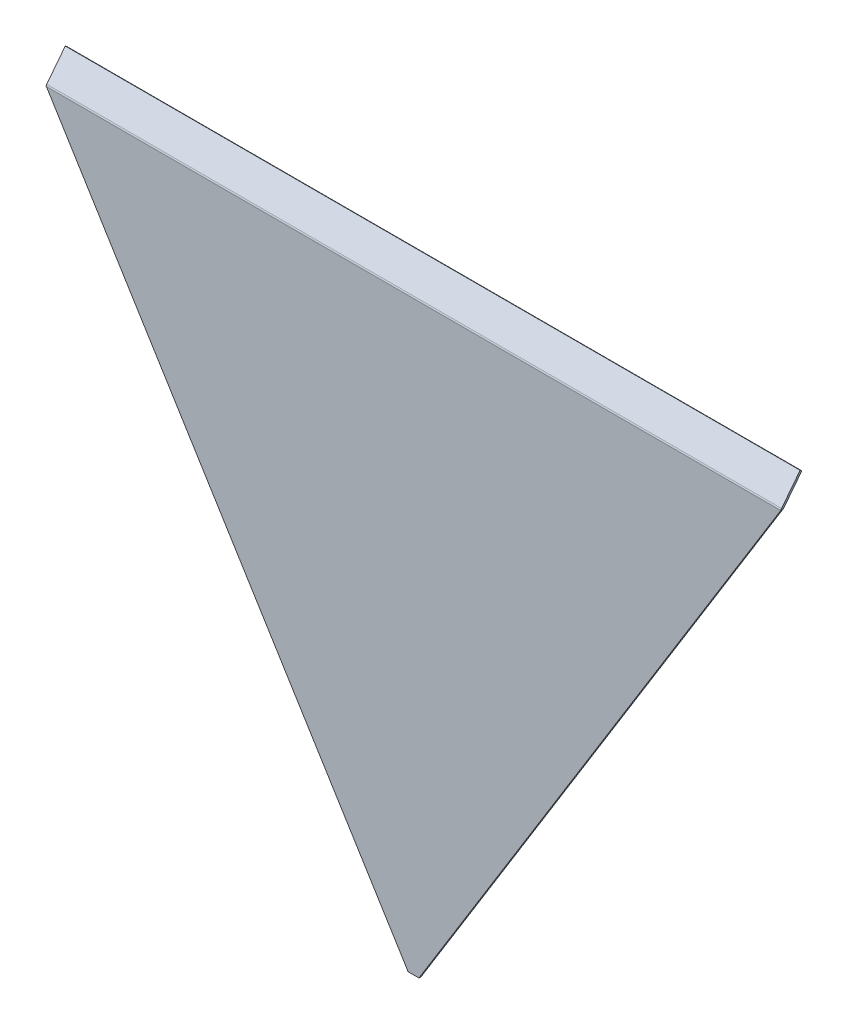
ISO-10303-21;
HEADER;
FILE_DESCRIPTION(('STEP AP214'),'2;1');
FILE_NAME('part.step','',(''),(''),'','','');
FILE_SCHEMA(('AUTOMOTIVE_DESIGN { 1 0 10303 214 1 1 1 1 }'));
ENDSEC;
DATA;
#1=APPLICATION_CONTEXT('core data for automotive mechanical design processes');
#2=APPLICATION_PROTOCOL_DEFINITION('international standard','automotive_design',2000,#1);
#3=PRODUCT_CONTEXT('',#1,'mechanical');
#4=PRODUCT('Part','Part','',(#3));
#5=PRODUCT_RELATED_PRODUCT_CATEGORY('part','',(#4));
#6=PRODUCT_DEFINITION_FORMATION('','',#4);
#7=PRODUCT_DEFINITION_CONTEXT('part definition',#1,'design');
#8=PRODUCT_DEFINITION('design','',#6,#7);
#9=PRODUCT_DEFINITION_SHAPE('','',#8);
#10=(LENGTH_UNIT() NAMED_UNIT(*) SI_UNIT(.MILLI.,.METRE.));
#11=(NAMED_UNIT(*) PLANE_ANGLE_UNIT() SI_UNIT($,.RADIAN.));
#12=(NAMED_UNIT(*) SI_UNIT($,.STERADIAN.) SOLID_ANGLE_UNIT());
#13=UNCERTAINTY_MEASURE_WITH_UNIT(LENGTH_MEASURE(1.E-05),#10,'distance_accuracy_value','');
#14=(GEOMETRIC_REPRESENTATION_CONTEXT(3) GLOBAL_UNCERTAINTY_ASSIGNED_CONTEXT((#13)) GLOBAL_UNIT_ASSIGNED_CONTEXT((#10,
#11,#12)) REPRESENTATION_CONTEXT('',''));
#15=CARTESIAN_POINT('',(0.,0.,0.));
#16=DIRECTION('',(0.,0.,1.));
#17=DIRECTION('',(1.,0.,0.));
#18=AXIS2_PLACEMENT_3D('',#15,#16,#17);
#19=CARTESIAN_POINT('',(-533.4,-14.4844496023644,-26.2223092044441));
#20=DIRECTION('',(0.,-0.788010753606722,0.61566147532566));
#21=DIRECTION('',(0.,-0.61566147532566,-0.788010753606722));
#22=AXIS2_PLACEMENT_3D('',#19,#20,#21);
#23=PLANE('',#22);
#24=DIRECTION('',(-1.,0.,0.));
#25=VECTOR('',#24,1.);
#26=CARTESIAN_POINT('',(-533.4,-16.4391747865234,-28.7242433471455));
#27=LINE('',#26,#25);
#28=CARTESIAN_POINT('',(533.4,-16.4391747865234,-28.7242433471455));
#29=VERTEX_POINT('',#28);
#30=CARTESIAN_POINT('',(-533.4,-16.4391747865234,-28.7242433471455));
#31=VERTEX_POINT('',#30);
#32=EDGE_CURVE('E76',#29,#31,#27,.T.);
#33=ORIENTED_EDGE('',*,*,#32,.T.);
#34=DIRECTION('',(0.,-0.61566147532566,-0.788010753606722));
#35=VECTOR('',#34,1.);
#36=CARTESIAN_POINT('',(-533.4,-14.4844496023644,-26.2223092044441));
#37=LINE('',#36,#35);
#38=CARTESIAN_POINT('',(-533.4,-14.4844496023644,-26.2223092044441));
#39=VERTEX_POINT('',#38);
#40=EDGE_CURVE('E346',#39,#31,#37,.T.);
#41=ORIENTED_EDGE('',*,*,#40,.F.);
#42=DIRECTION('',(-1.,0.,0.));
#43=VECTOR('',#42,1.);
#44=CARTESIAN_POINT('',(-533.4,-14.4844496023644,-26.2223092044441));
#45=LINE('',#44,#43);
#46=CARTESIAN_POINT('',(533.4,-14.4844496023644,-26.2223092044441));
#47=VERTEX_POINT('',#46);
#48=EDGE_CURVE('E47',#47,#39,#45,.T.);
#49=ORIENTED_EDGE('',*,*,#48,.F.);
#50=DIRECTION('',(0.,-0.61566147532566,-0.788010753606722));
#51=VECTOR('',#50,1.);
#52=CARTESIAN_POINT('',(533.4,-14.4844496023644,-26.2223092044441));
#53=LINE('',#52,#51);
#54=EDGE_CURVE('E344',#47,#29,#53,.T.);
#55=ORIENTED_EDGE('',*,*,#54,.T.);
#56=EDGE_LOOP('',(#33,#41,#49,#55));
#57=FACE_BOUND('',#56,.T.);
#58=ADVANCED_FACE('F37',(#57),#23,.F.);
#59=CARTESIAN_POINT('',(-533.4,-14.4844496023644,-26.2223092044441));
#60=DIRECTION('',(1.,0.,0.));
#61=DIRECTION('',(0.,-0.61566147532566,-0.788010753606722));
#62=AXIS2_PLACEMENT_3D('',#59,#60,#61);
#63=PLANE('',#62);
#64=DIRECTION('',(0.,-0.61566147532566,-0.788010753606722));
#65=VECTOR('',#64,1.);
#66=CARTESIAN_POINT('',(-533.4,-49.0111407716429,0.752898336949668));
#67=LINE('',#66,#65);
#68=CARTESIAN_POINT('',(-533.4,-49.0111407716429,0.752898336949654));
#69=VERTEX_POINT('',#68);
#70=CARTESIAN_POINT('',(-533.4,-50.9658659558019,-1.74903580575169));
#71=VERTEX_POINT('',#70);
#72=EDGE_CURVE('E41',#69,#71,#67,.T.);
#73=ORIENTED_EDGE('',*,*,#72,.F.);
#74=DIRECTION('',(0.,-0.788010753606722,0.61566147532566));
#75=VECTOR('',#74,1.);
#76=CARTESIAN_POINT('',(-533.4,-14.4844496023644,-26.2223092044441));
#77=LINE('',#76,#75);
#78=EDGE_CURVE('E524',#39,#69,#77,.T.);
#79=ORIENTED_EDGE('',*,*,#78,.F.);
#80=ORIENTED_EDGE('',*,*,#40,.T.);
#81=DIRECTION('',(0.,-0.788010753606722,0.61566147532566));
#82=VECTOR('',#81,1.);
#83=CARTESIAN_POINT('',(-533.4,-16.4391747865234,-28.7242433471455));
#84=LINE('',#83,#82);
#85=EDGE_CURVE('E343',#31,#71,#84,.T.);
#86=ORIENTED_EDGE('',*,*,#85,.T.);
#87=EDGE_LOOP('',(#73,#79,#80,#86));
#88=FACE_BOUND('',#87,.T.);
#89=ADVANCED_FACE('F322',(#88),#63,.F.);
#90=CARTESIAN_POINT('',(0.,-14.4844496023644,-26.2223092044441));
#91=DIRECTION('',(0.,0.61566147532566,0.788010753606722));
#92=DIRECTION('',(1.,0.,0.));
#93=AXIS2_PLACEMENT_3D('',#90,#91,#92);
#94=PLANE('',#93);
#95=ORIENTED_EDGE('',*,*,#78,.T.);
#96=DIRECTION('',(1.,0.,0.));
#97=VECTOR('',#96,1.);
#98=CARTESIAN_POINT('',(0.,-49.0111407716429,0.752898336949671));
#99=LINE('',#98,#97);
#100=CARTESIAN_POINT('',(533.4,-49.0111407716429,0.752898336949668));
#101=VERTEX_POINT('',#100);
#102=EDGE_CURVE('E153',#69,#101,#99,.T.);
#103=ORIENTED_EDGE('',*,*,#102,.T.);
#104=DIRECTION('',(0.,0.788010753606722,-0.61566147532566));
#105=VECTOR('',#104,1.);
#106=CARTESIAN_POINT('',(533.4,-14.4844496023644,-26.2223092044441));
#107=LINE('',#106,#105);
#108=EDGE_CURVE('E337',#101,#47,#107,.T.);
#109=ORIENTED_EDGE('',*,*,#108,.T.);
#110=ORIENTED_EDGE('',*,*,#48,.T.);
#111=EDGE_LOOP('',(#95,#103,#109,#110));
#112=FACE_BOUND('',#111,.T.);
#113=ADVANCED_FACE('F325',(#112),#94,.T.);
#114=CARTESIAN_POINT('',(533.4,-14.4844496023644,-26.2223092044441));
#115=DIRECTION('',(-1.,0.,0.));
#116=DIRECTION('',(0.,0.61566147532566,0.788010753606722));
#117=AXIS2_PLACEMENT_3D('',#114,#115,#116);
#118=PLANE('',#117);
#119=DIRECTION('',(0.,0.61566147532566,0.788010753606722));
#120=VECTOR('',#119,1.);
#121=CARTESIAN_POINT('',(533.4,-49.0111407716429,0.752898336949668));
#122=LINE('',#121,#120);
#123=CARTESIAN_POINT('',(533.4,-50.9658659558019,-1.74903580575169));
#124=VERTEX_POINT('',#123);
#125=EDGE_CURVE('E336',#124,#101,#122,.T.);
#126=ORIENTED_EDGE('',*,*,#125,.F.);
#127=DIRECTION('',(0.,0.788010753606722,-0.61566147532566));
#128=VECTOR('',#127,1.);
#129=CARTESIAN_POINT('',(533.4,-16.4391747865234,-28.7242433471455));
#130=LINE('',#129,#128);
#131=EDGE_CURVE('E11',#124,#29,#130,.T.);
#132=ORIENTED_EDGE('',*,*,#131,.T.);
#133=ORIENTED_EDGE('',*,*,#54,.F.);
#134=ORIENTED_EDGE('',*,*,#108,.F.);
#135=EDGE_LOOP('',(#126,#132,#133,#134));
#136=FACE_BOUND('',#135,.T.);
#137=ADVANCED_FACE('F328',(#136),#118,.F.);
#138=CARTESIAN_POINT('',(0.,-16.4391747865234,-28.7242433471455));
#139=DIRECTION('',(0.,0.61566147532566,0.788010753606722));
#140=DIRECTION('',(1.,0.,0.));
#141=AXIS2_PLACEMENT_3D('',#138,#139,#140);
#142=PLANE('',#141);
#143=DIRECTION('',(1.,0.,0.));
#144=VECTOR('',#143,1.);
#145=CARTESIAN_POINT('',(0.,-50.9658659558019,-1.74903580575168));
#146=LINE('',#145,#144);
#147=EDGE_CURVE('E338',#71,#124,#146,.T.);
#148=ORIENTED_EDGE('',*,*,#147,.F.);
#149=ORIENTED_EDGE('',*,*,#85,.F.);
#150=ORIENTED_EDGE('',*,*,#32,.F.);
#151=ORIENTED_EDGE('',*,*,#131,.F.);
#152=EDGE_LOOP('',(#148,#149,#150,#151));
#153=FACE_BOUND('',#152,.T.);
#154=ADVANCED_FACE('F39',(#153),#142,.F.);
#155=CARTESIAN_POINT('',(533.4,-50.8000000000002,1.58749999999999));
#156=DIRECTION('',(-0.850797997359292,0.525492880721916,0.));
#157=DIRECTION('',(-0.525492880721916,-0.850797997359293,0.));
#158=AXIS2_PLACEMENT_3D('',#155,#156,#157);
#159=PLANE('',#158);
#160=DIRECTION('',(0.525492880721916,0.850797997359293,0.));
#161=VECTOR('',#160,1.);
#162=CARTESIAN_POINT('',(533.4,-50.8000000000002,-1.58750000000001));
#163=LINE('',#162,#161);
#164=CARTESIAN_POINT('',(7.84411764705883,-901.7,-1.58750000000012));
#165=VERTEX_POINT('',#164);
#166=CARTESIAN_POINT('',(533.007794117647,-51.435,-1.58750000000001));
#167=VERTEX_POINT('',#166);
#168=EDGE_CURVE('E280',#165,#167,#163,.T.);
#169=ORIENTED_EDGE('',*,*,#168,.T.);
#170=CARTESIAN_POINT('',(533.007794117647,-51.435,1.58749999999999));
#171=CARTESIAN_POINT('',(533.007794117647,-51.435,-1.58750000000002));
#172=B_SPLINE_CURVE_WITH_KNOTS('',1,(#170,#171),.UNSPECIFIED.,.F.,.F.,(2,2),(0.,1.),.UNSPECIFIED.);
#173=CARTESIAN_POINT('',(533.007794117647,-51.435,1.58749999999999));
#174=VERTEX_POINT('',#173);
#175=EDGE_CURVE('E264',#167,#174,#172,.F.);
#176=ORIENTED_EDGE('',*,*,#175,.T.);
#177=DIRECTION('',(0.525492880721916,0.850797997359293,0.));
#178=VECTOR('',#177,1.);
#179=CARTESIAN_POINT('',(533.4,-50.8000000000002,1.58749999999999));
#180=LINE('',#179,#178);
#181=CARTESIAN_POINT('',(7.84411764705883,-901.7,1.58749999999987));
#182=VERTEX_POINT('',#181);
#183=EDGE_CURVE('E276',#182,#174,#180,.T.);
#184=ORIENTED_EDGE('',*,*,#183,.F.);
#185=DIRECTION('',(0.,0.,-1.));
#186=VECTOR('',#185,1.);
#187=CARTESIAN_POINT('',(7.84411764705883,-901.7,1.58749999999987));
#188=LINE('',#187,#186);
#189=EDGE_CURVE('E282',#182,#165,#188,.T.);
#190=ORIENTED_EDGE('',*,*,#189,.T.);
#191=EDGE_LOOP('',(#169,#176,#184,#190));
#192=FACE_BOUND('',#191,.T.);
#193=ADVANCED_FACE('F224',(#192),#159,.F.);
#194=CARTESIAN_POINT('',(-533.4,-50.8000000000002,1.58749999999999));
#195=DIRECTION('',(0.850797997359292,0.525492880721916,0.));
#196=DIRECTION('',(-0.525492880721916,0.850797997359293,0.));
#197=AXIS2_PLACEMENT_3D('',#194,#195,#196);
#198=PLANE('',#197);
#199=DIRECTION('',(0.525492880721916,-0.850797997359293,0.));
#200=VECTOR('',#199,1.);
#201=CARTESIAN_POINT('',(-533.4,-50.8000000000002,1.58749999999999));
#202=LINE('',#201,#200);
#203=CARTESIAN_POINT('',(-533.007794117647,-51.435,1.5875));
#204=VERTEX_POINT('',#203);
#205=CARTESIAN_POINT('',(-7.84411764705883,-901.7,1.58749999999998));
#206=VERTEX_POINT('',#205);
#207=EDGE_CURVE('E277',#204,#206,#202,.T.);
#208=ORIENTED_EDGE('',*,*,#207,.F.);
#209=CARTESIAN_POINT('',(-533.007794117647,-51.435,-1.58750000000002));
#210=CARTESIAN_POINT('',(-533.007794117647,-51.435,1.58749999999999));
#211=B_SPLINE_CURVE_WITH_KNOTS('',1,(#209,#210),.UNSPECIFIED.,.F.,.F.,(2,2),(0.,1.),.UNSPECIFIED.);
#212=CARTESIAN_POINT('',(-533.007794117647,-51.435,-1.5875));
#213=VERTEX_POINT('',#212);
#214=EDGE_CURVE('E91',#204,#213,#211,.F.);
#215=ORIENTED_EDGE('',*,*,#214,.T.);
#216=DIRECTION('',(0.525492880721916,-0.850797997359293,0.));
#217=VECTOR('',#216,1.);
#218=CARTESIAN_POINT('',(-533.4,-50.8000000000002,-1.5875));
#219=LINE('',#218,#217);
#220=CARTESIAN_POINT('',(-7.84411764705883,-901.7,-1.58750000000006));
#221=VERTEX_POINT('',#220);
#222=EDGE_CURVE('E281',#213,#221,#219,.T.);
#223=ORIENTED_EDGE('',*,*,#222,.T.);
#224=DIRECTION('',(0.,0.,-1.));
#225=VECTOR('',#224,1.);
#226=CARTESIAN_POINT('',(-7.84411764705883,-901.7,1.58749999999998));
#227=LINE('',#226,#225);
#228=EDGE_CURVE('E285',#206,#221,#227,.T.);
#229=ORIENTED_EDGE('',*,*,#228,.F.);
#230=EDGE_LOOP('',(#208,#215,#223,#229));
#231=FACE_BOUND('',#230,.T.);
#232=ADVANCED_FACE('F303',(#231),#198,.F.);
#233=CARTESIAN_POINT('',(0.,0.,-1.58750000000001));
#234=DIRECTION('',(0.,0.,1.));
#235=DIRECTION('',(1.,0.,0.));
#236=AXIS2_PLACEMENT_3D('',#233,#234,#235);
#237=PLANE('',#236);
#238=ORIENTED_EDGE('',*,*,#222,.F.);
#239=DIRECTION('',(1.,0.,0.));
#240=VECTOR('',#239,1.);
#241=CARTESIAN_POINT('',(0.,-51.435,-1.58750000000001));
#242=LINE('',#241,#240);
#243=EDGE_CURVE('E288',#213,#167,#242,.T.);
#244=ORIENTED_EDGE('',*,*,#243,.T.);
#245=ORIENTED_EDGE('',*,*,#168,.F.);
#246=DIRECTION('',(1.,0.,0.));
#247=VECTOR('',#246,1.);
#248=CARTESIAN_POINT('',(-7.84411764705883,-901.7,-1.58750000000006));
#249=LINE('',#248,#247);
#250=EDGE_CURVE('E278',#221,#165,#249,.T.);
#251=ORIENTED_EDGE('',*,*,#250,.F.);
#252=EDGE_LOOP('',(#238,#244,#245,#251));
#253=FACE_BOUND('',#252,.T.);
#254=ADVANCED_FACE('F312',(#253),#237,.F.);
#255=CARTESIAN_POINT('',(-7.84411764705883,-901.7,1.58749999999998));
#256=DIRECTION('',(0.,1.,0.));
#257=DIRECTION('',(0.,0.,1.));
#258=AXIS2_PLACEMENT_3D('',#255,#256,#257);
#259=PLANE('',#258);
#260=ORIENTED_EDGE('',*,*,#250,.T.);
#261=ORIENTED_EDGE('',*,*,#189,.F.);
#262=DIRECTION('',(1.,0.,0.));
#263=VECTOR('',#262,1.);
#264=CARTESIAN_POINT('',(-7.84411764705883,-901.7,1.58749999999998));
#265=LINE('',#264,#263);
#266=EDGE_CURVE('E269',#206,#182,#265,.T.);
#267=ORIENTED_EDGE('',*,*,#266,.F.);
#268=ORIENTED_EDGE('',*,*,#228,.T.);
#269=EDGE_LOOP('',(#260,#261,#267,#268));
#270=FACE_BOUND('',#269,.T.);
#271=ADVANCED_FACE('F313',(#270),#259,.F.);
#272=CARTESIAN_POINT('',(0.,0.,1.5875));
#273=DIRECTION('',(0.,0.,1.));
#274=DIRECTION('',(1.,0.,0.));
#275=AXIS2_PLACEMENT_3D('',#272,#273,#274);
#276=PLANE('',#275);
#277=DIRECTION('',(1.,0.,0.));
#278=VECTOR('',#277,1.);
#279=CARTESIAN_POINT('',(0.,-51.435,1.5875));
#280=LINE('',#279,#278);
#281=EDGE_CURVE('E84',#204,#174,#280,.T.);
#282=ORIENTED_EDGE('',*,*,#281,.F.);
#283=ORIENTED_EDGE('',*,*,#207,.T.);
#284=ORIENTED_EDGE('',*,*,#266,.T.);
#285=ORIENTED_EDGE('',*,*,#183,.T.);
#286=EDGE_LOOP('',(#282,#283,#284,#285));
#287=FACE_BOUND('',#286,.T.);
#288=ADVANCED_FACE('F314',(#287),#276,.T.);
#289=CARTESIAN_POINT('',(533.4,-51.435,-2.34950000000001));
#290=DIRECTION('',(1.,0.,0.));
#291=DIRECTION('',(0.,0.,-1.));
#292=AXIS2_PLACEMENT_3D('',#289,#290,#291);
#293=PLANE('',#292);
#294=CARTESIAN_POINT('',(533.4,-51.3929066427682,-1.58866352001436));
#295=CARTESIAN_POINT('',(533.4,-51.2175176543024,1.58148847992585));
#296=B_SPLINE_CURVE_WITH_KNOTS('',1,(#294,#295),.UNSPECIFIED.,.F.,.F.,(2,2),(0.,1.),.UNSPECIFIED.);
#297=CARTESIAN_POINT('',(533.4,-51.3929066427682,-1.58866352001436));
#298=VERTEX_POINT('',#297);
#299=CARTESIAN_POINT('',(533.4,-51.2175176543024,1.58148847992585));
#300=VERTEX_POINT('',#299);
#301=EDGE_CURVE('E144',#298,#300,#296,.T.);
#302=ORIENTED_EDGE('',*,*,#301,.F.);
#303=CARTESIAN_POINT('',(533.4,-51.435,-2.34950000000001));
#304=DIRECTION('',(1.,0.,0.));
#305=DIRECTION('',(0.,0.,-1.));
#306=AXIS2_PLACEMENT_3D('',#303,#304,#305);
#307=CIRCLE('',#306,0.761999999999997);
#308=EDGE_CURVE('E355',#298,#124,#307,.F.);
#309=ORIENTED_EDGE('',*,*,#308,.T.);
#310=ORIENTED_EDGE('',*,*,#125,.T.);
#311=CARTESIAN_POINT('',(533.4,-51.435,-2.34950000000001));
#312=DIRECTION('',(1.,0.,0.));
#313=DIRECTION('',(0.,0.,-1.));
#314=AXIS2_PLACEMENT_3D('',#311,#312,#313);
#315=CIRCLE('',#314,3.937);
#316=EDGE_CURVE('E70',#300,#101,#315,.F.);
#317=ORIENTED_EDGE('',*,*,#316,.F.);
#318=EDGE_LOOP('',(#302,#309,#310,#317));
#319=FACE_BOUND('',#318,.T.);
#320=ADVANCED_FACE('F222',(#319),#293,.T.);
#321=CARTESIAN_POINT('',(-533.4,-51.435,-2.34950000000001));
#322=DIRECTION('',(-1.,0.,0.));
#323=DIRECTION('',(0.,0.,1.));
#324=AXIS2_PLACEMENT_3D('',#321,#322,#323);
#325=PLANE('',#324);
#326=ORIENTED_EDGE('',*,*,#72,.T.);
#327=CARTESIAN_POINT('',(-533.4,-51.435,-2.34950000000001));
#328=DIRECTION('',(1.,0.,0.));
#329=DIRECTION('',(0.,0.,-1.));
#330=AXIS2_PLACEMENT_3D('',#327,#328,#329);
#331=CIRCLE('',#330,0.761999999999997);
#332=CARTESIAN_POINT('',(-533.4,-51.3929066427682,-1.58866352001435));
#333=VERTEX_POINT('',#332);
#334=EDGE_CURVE('E138',#71,#333,#331,.T.);
#335=ORIENTED_EDGE('',*,*,#334,.T.);
#336=CARTESIAN_POINT('',(-533.4,-51.2175176543024,1.58148847992586));
#337=CARTESIAN_POINT('',(-533.4,-51.3929066427682,-1.58866352001435));
#338=B_SPLINE_CURVE_WITH_KNOTS('',1,(#336,#337),.UNSPECIFIED.,.F.,.F.,(2,2),(0.,1.),.UNSPECIFIED.);
#339=CARTESIAN_POINT('',(-533.4,-51.2175176543024,1.58148847992586));
#340=VERTEX_POINT('',#339);
#341=EDGE_CURVE('E131',#333,#340,#338,.F.);
#342=ORIENTED_EDGE('',*,*,#341,.T.);
#343=CARTESIAN_POINT('',(-533.4,-51.435,-2.34950000000001));
#344=DIRECTION('',(1.,0.,0.));
#345=DIRECTION('',(0.,0.,-1.));
#346=AXIS2_PLACEMENT_3D('',#343,#344,#345);
#347=CIRCLE('',#346,3.937);
#348=EDGE_CURVE('E135',#69,#340,#347,.T.);
#349=ORIENTED_EDGE('',*,*,#348,.F.);
#350=EDGE_LOOP('',(#326,#335,#342,#349));
#351=FACE_BOUND('',#350,.T.);
#352=ADVANCED_FACE('F134',(#351),#325,.T.);
#353=CARTESIAN_POINT('',(-533.4,-51.2175176543024,1.58148847992586));
#354=CARTESIAN_POINT('',(-533.269264697073,-51.2899379450059,1.58549514002643));
#355=CARTESIAN_POINT('',(-533.138529420575,-51.3624689595363,1.58749999999999));
#356=CARTESIAN_POINT('',(-533.007794117647,-51.435,1.58749999999999));
#357=CARTESIAN_POINT('',(-533.4,-51.3929066427682,-1.58866352001435));
#358=CARTESIAN_POINT('',(-533.269264705455,-51.4069234723283,-1.58788803746395));
#359=CARTESIAN_POINT('',(-533.138529412192,-51.4209617350039,-1.58750000000001));
#360=CARTESIAN_POINT('',(-533.007794117647,-51.435,-1.58750000000002));
#361=B_SPLINE_SURFACE_WITH_KNOTS('',1,3,((#353,#354,#355,#356),(#357,#358,#359,#360)),
.UNSPECIFIED.,.F.,.F.,.F.,(2,2),(4,4),(0.,1.),(0.,1.),.UNSPECIFIED.);
#362=CARTESIAN_POINT('',(-533.4,-51.3929066427682,-1.58866352001435));
#363=CARTESIAN_POINT('',(-533.269264705455,-51.4069234723283,-1.58788803746395));
#364=CARTESIAN_POINT('',(-533.138529412192,-51.4209617350039,-1.58750000000001));
#365=CARTESIAN_POINT('',(-533.007794117647,-51.435,-1.58750000000002));
#366=B_SPLINE_CURVE_WITH_KNOTS('',3,(#362,#363,#364,#365),.UNSPECIFIED.,.F.,.F.,(4,4),(0.,1.),.UNSPECIFIED.);
#367=EDGE_CURVE('E353',#333,#213,#366,.T.);
#368=CARTESIAN_POINT('',(-533.007794117647,-51.435,1.58749999999999));
#369=CARTESIAN_POINT('',(-533.138529420575,-51.3624689595363,1.58749999999999));
#370=CARTESIAN_POINT('',(-533.269264697073,-51.2899379450059,1.58549514002643));
#371=CARTESIAN_POINT('',(-533.4,-51.2175176543024,1.58148847992586));
#372=B_SPLINE_CURVE_WITH_KNOTS('',3,(#368,#369,#370,#371),.UNSPECIFIED.,.F.,.F.,(4,4),(0.,1.),.UNSPECIFIED.);
#373=EDGE_CURVE('E150',#340,#204,#372,.F.);
#374=ORIENTED_EDGE('',*,*,#341,.F.);
#375=ORIENTED_EDGE('',*,*,#367,.T.);
#376=ORIENTED_EDGE('',*,*,#214,.F.);
#377=ORIENTED_EDGE('',*,*,#373,.F.);
#378=EDGE_LOOP('',(#374,#375,#376,#377));
#379=FACE_BOUND('',#378,.T.);
#380=ADVANCED_FACE('F156',(#379),#361,.T.);
#381=CARTESIAN_POINT('',(533.007794117647,-51.435,1.58749999999999));
#382=CARTESIAN_POINT('',(533.138529420574,-51.3624689595367,1.5875));
#383=CARTESIAN_POINT('',(533.269264697073,-51.2899379450057,1.58549514002641));
#384=CARTESIAN_POINT('',(533.4,-51.2175176543024,1.58148847992585));
#385=CARTESIAN_POINT('',(533.007794117647,-51.435,-1.58750000000002));
#386=CARTESIAN_POINT('',(533.138529412192,-51.4209617350039,-1.58750000000001));
#387=CARTESIAN_POINT('',(533.269264705455,-51.4069234723283,-1.58788803746396));
#388=CARTESIAN_POINT('',(533.4,-51.3929066427682,-1.58866352001436));
#389=B_SPLINE_SURFACE_WITH_KNOTS('',1,3,((#381,#382,#383,#384),(#385,#386,#387,#388)),
.UNSPECIFIED.,.F.,.F.,.F.,(2,2),(4,4),(0.,1.),(0.,1.),.UNSPECIFIED.);
#390=CARTESIAN_POINT('',(533.007794117647,-51.435,-1.58750000000002));
#391=CARTESIAN_POINT('',(533.138529412192,-51.4209617350039,-1.58750000000001));
#392=CARTESIAN_POINT('',(533.269264705455,-51.4069234723283,-1.58788803746396));
#393=CARTESIAN_POINT('',(533.4,-51.3929066427682,-1.58866352001436));
#394=B_SPLINE_CURVE_WITH_KNOTS('',3,(#390,#391,#392,#393),.UNSPECIFIED.,.F.,.F.,(4,4),(0.,1.),.UNSPECIFIED.);
#395=EDGE_CURVE('E158',#167,#298,#394,.T.);
#396=CARTESIAN_POINT('',(533.4,-51.2175176543024,1.58148847992585));
#397=CARTESIAN_POINT('',(533.269264697073,-51.2899379450057,1.58549514002641));
#398=CARTESIAN_POINT('',(533.138529420574,-51.3624689595367,1.5875));
#399=CARTESIAN_POINT('',(533.007794117647,-51.435,1.58749999999999));
#400=B_SPLINE_CURVE_WITH_KNOTS('',3,(#396,#397,#398,#399),.UNSPECIFIED.,.F.,.F.,(4,4),(0.,1.),.UNSPECIFIED.);
#401=EDGE_CURVE('E145',#174,#300,#400,.F.);
#402=ORIENTED_EDGE('',*,*,#395,.T.);
#403=ORIENTED_EDGE('',*,*,#301,.T.);
#404=ORIENTED_EDGE('',*,*,#401,.F.);
#405=ORIENTED_EDGE('',*,*,#175,.F.);
#406=EDGE_LOOP('',(#402,#403,#404,#405));
#407=FACE_BOUND('',#406,.T.);
#408=ADVANCED_FACE('F179',(#407),#389,.T.);
#409=CARTESIAN_POINT('',(-1930.23041584331,-51.435,-2.34950000000001));
#410=DIRECTION('',(1.,0.,0.));
#411=DIRECTION('',(0.,0.,-1.));
#412=AXIS2_PLACEMENT_3D('',#409,#410,#411);
#413=CYLINDRICAL_SURFACE('',#412,3.937);
#414=ORIENTED_EDGE('',*,*,#281,.T.);
#415=ORIENTED_EDGE('',*,*,#401,.T.);
#416=ORIENTED_EDGE('',*,*,#316,.T.);
#417=ORIENTED_EDGE('',*,*,#102,.F.);
#418=ORIENTED_EDGE('',*,*,#348,.T.);
#419=ORIENTED_EDGE('',*,*,#373,.T.);
#420=EDGE_LOOP('',(#414,#415,#416,#417,#418,#419));
#421=FACE_BOUND('',#420,.T.);
#422=ADVANCED_FACE('F149',(#421),#413,.T.);
#423=CARTESIAN_POINT('',(-1930.23041584331,-51.435,-2.34950000000001));
#424=DIRECTION('',(1.,0.,0.));
#425=DIRECTION('',(0.,0.,-1.));
#426=AXIS2_PLACEMENT_3D('',#423,#424,#425);
#427=CYLINDRICAL_SURFACE('',#426,0.761999999999997);
#428=ORIENTED_EDGE('',*,*,#243,.F.);
#429=ORIENTED_EDGE('',*,*,#367,.F.);
#430=ORIENTED_EDGE('',*,*,#334,.F.);
#431=ORIENTED_EDGE('',*,*,#147,.T.);
#432=ORIENTED_EDGE('',*,*,#308,.F.);
#433=ORIENTED_EDGE('',*,*,#395,.F.);
#434=EDGE_LOOP('',(#428,#429,#430,#431,#432,#433));
#435=FACE_BOUND('',#434,.T.);
#436=ADVANCED_FACE('F180',(#435),#427,.F.);
#437=CLOSED_SHELL('',(#58,#89,#113,#137,#154,#193,#232,#254,#271,#288,#320,#352,#380,#408,#422,#436));
#438=MANIFOLD_SOLID_BREP('B2',#437);
#439=ADVANCED_BREP_SHAPE_REPRESENTATION('',(#18,#438),#14);
#440=SHAPE_DEFINITION_REPRESENTATION(#9,#439);
ENDSEC;
END-ISO-10303-21;
